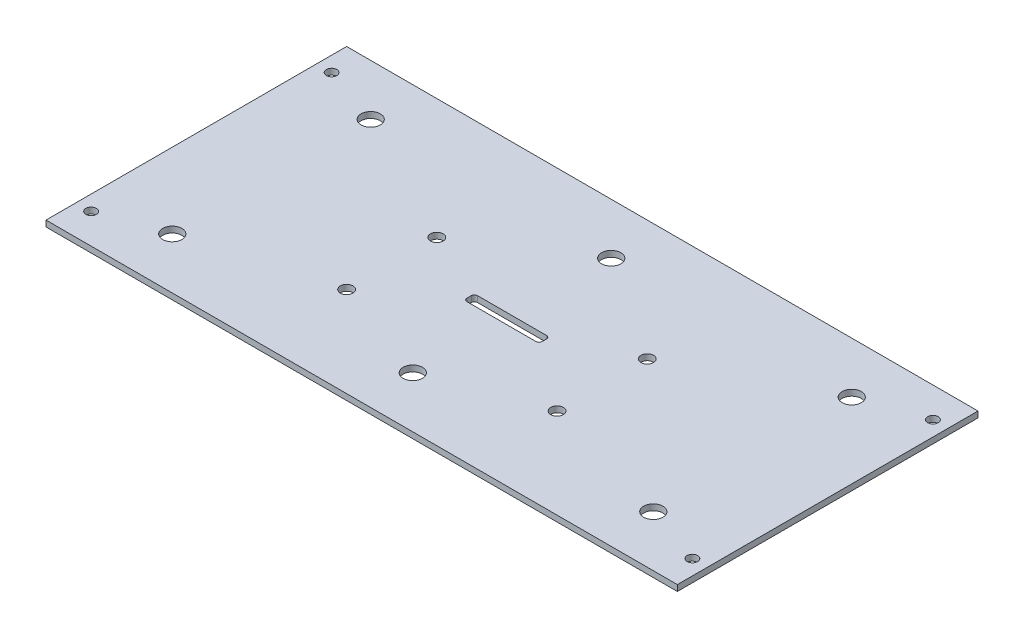
ISO-10303-21;
HEADER;
FILE_DESCRIPTION(('STEP AP214'),'2;1');
FILE_NAME('part.step','',(''),(''),'','','');
FILE_SCHEMA(('AUTOMOTIVE_DESIGN { 1 0 10303 214 1 1 1 1 }'));
ENDSEC;
DATA;
#1=APPLICATION_CONTEXT('core data for automotive mechanical design processes');
#2=APPLICATION_PROTOCOL_DEFINITION('international standard','automotive_design',2000,#1);
#3=PRODUCT_CONTEXT('',#1,'mechanical');
#4=PRODUCT('Part','Part','',(#3));
#5=PRODUCT_RELATED_PRODUCT_CATEGORY('part','',(#4));
#6=PRODUCT_DEFINITION_FORMATION('','',#4);
#7=PRODUCT_DEFINITION_CONTEXT('part definition',#1,'design');
#8=PRODUCT_DEFINITION('design','',#6,#7);
#9=PRODUCT_DEFINITION_SHAPE('','',#8);
#10=(LENGTH_UNIT() NAMED_UNIT(*) SI_UNIT(.MILLI.,.METRE.));
#11=(NAMED_UNIT(*) PLANE_ANGLE_UNIT() SI_UNIT($,.RADIAN.));
#12=(NAMED_UNIT(*) SI_UNIT($,.STERADIAN.) SOLID_ANGLE_UNIT());
#13=UNCERTAINTY_MEASURE_WITH_UNIT(LENGTH_MEASURE(1.E-05),#10,'distance_accuracy_value','');
#14=(GEOMETRIC_REPRESENTATION_CONTEXT(3) GLOBAL_UNCERTAINTY_ASSIGNED_CONTEXT((#13)) GLOBAL_UNIT_ASSIGNED_CONTEXT((#10,
#11,#12)) REPRESENTATION_CONTEXT('',''));
#15=CARTESIAN_POINT('',(0.,0.,0.));
#16=DIRECTION('',(0.,0.,1.));
#17=DIRECTION('',(1.,0.,0.));
#18=AXIS2_PLACEMENT_3D('',#15,#16,#17);
#19=CARTESIAN_POINT('',(0.,2.,0.));
#20=DIRECTION('',(0.,-1.,0.));
#21=DIRECTION('',(0.,0.,-1.));
#22=AXIS2_PLACEMENT_3D('',#19,#20,#21);
#23=PLANE('',#22);
#24=DIRECTION('',(1.,0.,0.));
#25=VECTOR('',#24,1.);
#26=CARTESIAN_POINT('',(92.5,2.,-46.5));
#27=LINE('',#26,#25);
#28=CARTESIAN_POINT('',(93.5,2.,-46.5));
#29=VERTEX_POINT('',#28);
#30=CARTESIAN_POINT('',(116.5,2.,-46.5));
#31=VERTEX_POINT('',#30);
#32=EDGE_CURVE('E278',#29,#31,#27,.T.);
#33=ORIENTED_EDGE('',*,*,#32,.F.);
#34=CARTESIAN_POINT('',(93.5,2.,-47.5));
#35=DIRECTION('',(0.,-1.,0.));
#36=DIRECTION('',(0.,0.,-1.));
#37=AXIS2_PLACEMENT_3D('',#34,#35,#36);
#38=CIRCLE('',#37,1.);
#39=CARTESIAN_POINT('',(92.5,2.,-47.5));
#40=VERTEX_POINT('',#39);
#41=EDGE_CURVE('E43',#29,#40,#38,.T.);
#42=ORIENTED_EDGE('',*,*,#41,.T.);
#43=DIRECTION('',(0.,0.,1.));
#44=VECTOR('',#43,1.);
#45=CARTESIAN_POINT('',(92.5,2.,-50.));
#46=LINE('',#45,#44);
#47=CARTESIAN_POINT('',(92.5,2.,-49.));
#48=VERTEX_POINT('',#47);
#49=EDGE_CURVE('E658',#48,#40,#46,.T.);
#50=ORIENTED_EDGE('',*,*,#49,.F.);
#51=CARTESIAN_POINT('',(93.5,2.,-49.));
#52=DIRECTION('',(0.,-1.,0.));
#53=DIRECTION('',(0.,0.,-1.));
#54=AXIS2_PLACEMENT_3D('',#51,#52,#53);
#55=CIRCLE('',#54,1.);
#56=CARTESIAN_POINT('',(93.5,2.,-50.));
#57=VERTEX_POINT('',#56);
#58=EDGE_CURVE('E57',#48,#57,#55,.T.);
#59=ORIENTED_EDGE('',*,*,#58,.T.);
#60=DIRECTION('',(-1.,0.,0.));
#61=VECTOR('',#60,1.);
#62=CARTESIAN_POINT('',(92.5,2.,-50.));
#63=LINE('',#62,#61);
#64=CARTESIAN_POINT('',(116.5,2.,-50.));
#65=VERTEX_POINT('',#64);
#66=EDGE_CURVE('E274',#65,#57,#63,.T.);
#67=ORIENTED_EDGE('',*,*,#66,.F.);
#68=CARTESIAN_POINT('',(116.5,2.,-49.));
#69=DIRECTION('',(0.,-1.,0.));
#70=DIRECTION('',(0.,0.,-1.));
#71=AXIS2_PLACEMENT_3D('',#68,#69,#70);
#72=CIRCLE('',#71,1.);
#73=CARTESIAN_POINT('',(117.5,2.,-49.));
#74=VERTEX_POINT('',#73);
#75=EDGE_CURVE('E198',#65,#74,#72,.T.);
#76=ORIENTED_EDGE('',*,*,#75,.T.);
#77=DIRECTION('',(0.,0.,-1.));
#78=VECTOR('',#77,1.);
#79=CARTESIAN_POINT('',(117.5,2.,-50.));
#80=LINE('',#79,#78);
#81=CARTESIAN_POINT('',(117.5,2.,-47.5));
#82=VERTEX_POINT('',#81);
#83=EDGE_CURVE('E268',#82,#74,#80,.T.);
#84=ORIENTED_EDGE('',*,*,#83,.F.);
#85=CARTESIAN_POINT('',(116.5,2.,-47.5));
#86=DIRECTION('',(0.,-1.,0.));
#87=DIRECTION('',(0.,0.,-1.));
#88=AXIS2_PLACEMENT_3D('',#85,#86,#87);
#89=CIRCLE('',#88,1.);
#90=EDGE_CURVE('E194',#82,#31,#89,.T.);
#91=ORIENTED_EDGE('',*,*,#90,.T.);
#92=EDGE_LOOP('',(#33,#42,#50,#59,#67,#76,#84,#91));
#93=FACE_BOUND('',#92,.T.);
#94=CARTESIAN_POINT('',(70.,2.,-60.));
#95=DIRECTION('',(0.,1.,0.));
#96=DIRECTION('',(0.,0.,1.));
#97=AXIS2_PLACEMENT_3D('',#94,#95,#96);
#98=CIRCLE('',#97,2.1);
#99=CARTESIAN_POINT('',(70.,2.,-57.9));
#100=VERTEX_POINT('',#99);
#101=EDGE_CURVE('E165',#100,#100,#98,.T.);
#102=ORIENTED_EDGE('',*,*,#101,.F.);
#103=EDGE_LOOP('',(#102));
#104=FACE_BOUND('',#103,.T.);
#105=CARTESIAN_POINT('',(140.,2.,-60.));
#106=DIRECTION('',(0.,1.,0.));
#107=DIRECTION('',(0.,0.,1.));
#108=AXIS2_PLACEMENT_3D('',#105,#106,#107);
#109=CIRCLE('',#108,2.09999999999999);
#110=CARTESIAN_POINT('',(140.,2.,-57.9));
#111=VERTEX_POINT('',#110);
#112=EDGE_CURVE('E162',#111,#111,#109,.T.);
#113=ORIENTED_EDGE('',*,*,#112,.F.);
#114=EDGE_LOOP('',(#113));
#115=FACE_BOUND('',#114,.T.);
#116=CARTESIAN_POINT('',(140.,2.,-30.));
#117=DIRECTION('',(0.,1.,0.));
#118=DIRECTION('',(0.,0.,1.));
#119=AXIS2_PLACEMENT_3D('',#116,#117,#118);
#120=CIRCLE('',#119,2.09999999999999);
#121=CARTESIAN_POINT('',(140.,2.,-27.9));
#122=VERTEX_POINT('',#121);
#123=EDGE_CURVE('E161',#122,#122,#120,.T.);
#124=ORIENTED_EDGE('',*,*,#123,.F.);
#125=EDGE_LOOP('',(#124));
#126=FACE_BOUND('',#125,.T.);
#127=CARTESIAN_POINT('',(70.,2.,-30.));
#128=DIRECTION('',(0.,1.,0.));
#129=DIRECTION('',(0.,0.,1.));
#130=AXIS2_PLACEMENT_3D('',#127,#128,#129);
#131=CIRCLE('',#130,2.1);
#132=CARTESIAN_POINT('',(70.,2.,-27.9));
#133=VERTEX_POINT('',#132);
#134=EDGE_CURVE('E289',#133,#133,#131,.T.);
#135=ORIENTED_EDGE('',*,*,#134,.F.);
#136=EDGE_LOOP('',(#135));
#137=FACE_BOUND('',#136,.T.);
#138=DIRECTION('',(0.,0.,1.));
#139=VECTOR('',#138,1.);
#140=CARTESIAN_POINT('',(0.,2.,0.));
#141=LINE('',#140,#139);
#142=CARTESIAN_POINT('',(0.,2.,-100.));
#143=VERTEX_POINT('',#142);
#144=CARTESIAN_POINT('',(0.,2.,0.));
#145=VERTEX_POINT('',#144);
#146=EDGE_CURVE('E135',#143,#145,#141,.T.);
#147=ORIENTED_EDGE('',*,*,#146,.T.);
#148=DIRECTION('',(1.,0.,0.));
#149=VECTOR('',#148,1.);
#150=CARTESIAN_POINT('',(0.,2.,0.));
#151=LINE('',#150,#149);
#152=CARTESIAN_POINT('',(210.,2.,0.));
#153=VERTEX_POINT('',#152);
#154=EDGE_CURVE('E124',#145,#153,#151,.T.);
#155=ORIENTED_EDGE('',*,*,#154,.T.);
#156=DIRECTION('',(0.,0.,-1.));
#157=VECTOR('',#156,1.);
#158=CARTESIAN_POINT('',(210.,2.,0.));
#159=LINE('',#158,#157);
#160=CARTESIAN_POINT('',(210.,2.,-100.));
#161=VERTEX_POINT('',#160);
#162=EDGE_CURVE('E134',#153,#161,#159,.T.);
#163=ORIENTED_EDGE('',*,*,#162,.T.);
#164=DIRECTION('',(-1.,0.,0.));
#165=VECTOR('',#164,1.);
#166=CARTESIAN_POINT('',(0.,2.,-100.));
#167=LINE('',#166,#165);
#168=EDGE_CURVE('E140',#161,#143,#167,.T.);
#169=ORIENTED_EDGE('',*,*,#168,.T.);
#170=EDGE_LOOP('',(#147,#155,#163,#169));
#171=FACE_BOUND('',#170,.T.);
#172=CARTESIAN_POINT('',(105.,2.,-17.));
#173=DIRECTION('',(0.,1.,0.));
#174=DIRECTION('',(0.,0.,1.));
#175=AXIS2_PLACEMENT_3D('',#172,#173,#174);
#176=CIRCLE('',#175,3.2);
#177=CARTESIAN_POINT('',(105.,2.,-13.8));
#178=VERTEX_POINT('',#177);
#179=EDGE_CURVE('E350',#178,#178,#176,.T.);
#180=ORIENTED_EDGE('',*,*,#179,.F.);
#181=EDGE_LOOP('',(#180));
#182=FACE_BOUND('',#181,.T.);
#183=CARTESIAN_POINT('',(185.,2.,-17.));
#184=DIRECTION('',(0.,1.,0.));
#185=DIRECTION('',(0.,0.,1.));
#186=AXIS2_PLACEMENT_3D('',#183,#184,#185);
#187=CIRCLE('',#186,3.20000000000001);
#188=CARTESIAN_POINT('',(185.,2.,-13.8));
#189=VERTEX_POINT('',#188);
#190=EDGE_CURVE('E344',#189,#189,#187,.T.);
#191=ORIENTED_EDGE('',*,*,#190,.F.);
#192=EDGE_LOOP('',(#191));
#193=FACE_BOUND('',#192,.T.);
#194=CARTESIAN_POINT('',(25.,2.,-17.));
#195=DIRECTION('',(0.,1.,0.));
#196=DIRECTION('',(0.,0.,-1.));
#197=AXIS2_PLACEMENT_3D('',#194,#195,#196);
#198=CIRCLE('',#197,3.2);
#199=CARTESIAN_POINT('',(25.,2.,-20.2));
#200=VERTEX_POINT('',#199);
#201=EDGE_CURVE('E338',#200,#200,#198,.T.);
#202=ORIENTED_EDGE('',*,*,#201,.F.);
#203=EDGE_LOOP('',(#202));
#204=FACE_BOUND('',#203,.T.);
#205=CARTESIAN_POINT('',(25.,2.,-83.));
#206=DIRECTION('',(0.,1.,0.));
#207=DIRECTION('',(0.,0.,1.));
#208=AXIS2_PLACEMENT_3D('',#205,#206,#207);
#209=CIRCLE('',#208,3.2);
#210=CARTESIAN_POINT('',(25.,2.,-79.8));
#211=VERTEX_POINT('',#210);
#212=EDGE_CURVE('E332',#211,#211,#209,.T.);
#213=ORIENTED_EDGE('',*,*,#212,.F.);
#214=EDGE_LOOP('',(#213));
#215=FACE_BOUND('',#214,.T.);
#216=CARTESIAN_POINT('',(105.,2.,-83.));
#217=DIRECTION('',(0.,1.,0.));
#218=DIRECTION('',(0.,0.,-1.));
#219=AXIS2_PLACEMENT_3D('',#216,#217,#218);
#220=CIRCLE('',#219,3.19999999999999);
#221=CARTESIAN_POINT('',(105.,2.,-86.2));
#222=VERTEX_POINT('',#221);
#223=EDGE_CURVE('E326',#222,#222,#220,.T.);
#224=ORIENTED_EDGE('',*,*,#223,.F.);
#225=EDGE_LOOP('',(#224));
#226=FACE_BOUND('',#225,.T.);
#227=CARTESIAN_POINT('',(185.,2.,-83.));
#228=DIRECTION('',(0.,1.,0.));
#229=DIRECTION('',(0.,0.,-1.));
#230=AXIS2_PLACEMENT_3D('',#227,#228,#229);
#231=CIRCLE('',#230,3.20000000000001);
#232=CARTESIAN_POINT('',(185.,2.,-86.2));
#233=VERTEX_POINT('',#232);
#234=EDGE_CURVE('E320',#233,#233,#231,.T.);
#235=ORIENTED_EDGE('',*,*,#234,.F.);
#236=EDGE_LOOP('',(#235));
#237=FACE_BOUND('',#236,.T.);
#238=CARTESIAN_POINT('',(5.,2.,-10.));
#239=DIRECTION('',(0.,1.,0.));
#240=DIRECTION('',(0.,0.,1.));
#241=AXIS2_PLACEMENT_3D('',#238,#239,#240);
#242=CIRCLE('',#241,1.75);
#243=CARTESIAN_POINT('',(5.,2.,-8.25));
#244=VERTEX_POINT('',#243);
#245=EDGE_CURVE('E314',#244,#244,#242,.T.);
#246=ORIENTED_EDGE('',*,*,#245,.F.);
#247=EDGE_LOOP('',(#246));
#248=FACE_BOUND('',#247,.T.);
#249=CARTESIAN_POINT('',(5.,2.,-90.));
#250=DIRECTION('',(0.,1.,0.));
#251=DIRECTION('',(0.,0.,-1.));
#252=AXIS2_PLACEMENT_3D('',#249,#250,#251);
#253=CIRCLE('',#252,1.75);
#254=CARTESIAN_POINT('',(5.,2.,-91.75));
#255=VERTEX_POINT('',#254);
#256=EDGE_CURVE('E308',#255,#255,#253,.T.);
#257=ORIENTED_EDGE('',*,*,#256,.F.);
#258=EDGE_LOOP('',(#257));
#259=FACE_BOUND('',#258,.T.);
#260=CARTESIAN_POINT('',(205.,2.,-10.));
#261=DIRECTION('',(0.,1.,0.));
#262=DIRECTION('',(0.,0.,-1.));
#263=AXIS2_PLACEMENT_3D('',#260,#261,#262);
#264=CIRCLE('',#263,1.75000000000001);
#265=CARTESIAN_POINT('',(205.,2.,-11.75));
#266=VERTEX_POINT('',#265);
#267=EDGE_CURVE('E302',#266,#266,#264,.T.);
#268=ORIENTED_EDGE('',*,*,#267,.F.);
#269=EDGE_LOOP('',(#268));
#270=FACE_BOUND('',#269,.T.);
#271=CARTESIAN_POINT('',(205.,2.,-90.));
#272=DIRECTION('',(0.,1.,0.));
#273=DIRECTION('',(0.,0.,1.));
#274=AXIS2_PLACEMENT_3D('',#271,#272,#273);
#275=CIRCLE('',#274,1.75000000000001);
#276=CARTESIAN_POINT('',(205.,2.,-88.25));
#277=VERTEX_POINT('',#276);
#278=EDGE_CURVE('E296',#277,#277,#275,.T.);
#279=ORIENTED_EDGE('',*,*,#278,.F.);
#280=EDGE_LOOP('',(#279));
#281=FACE_BOUND('',#280,.T.);
#282=ADVANCED_FACE('F35',(#93,#104,#115,#126,#137,#171,#182,#193,#204,#215,#226,#237,#248,#259,
#270,#281),#23,.F.);
#283=CARTESIAN_POINT('',(0.,0.,0.));
#284=DIRECTION('',(0.,-1.,0.));
#285=DIRECTION('',(0.,0.,-1.));
#286=AXIS2_PLACEMENT_3D('',#283,#284,#285);
#287=PLANE('',#286);
#288=DIRECTION('',(0.,0.,-1.));
#289=VECTOR('',#288,1.);
#290=CARTESIAN_POINT('',(92.5,0.,0.));
#291=LINE('',#290,#289);
#292=CARTESIAN_POINT('',(92.5,0.,-47.5));
#293=VERTEX_POINT('',#292);
#294=CARTESIAN_POINT('',(92.5,0.,-49.));
#295=VERTEX_POINT('',#294);
#296=EDGE_CURVE('E172',#293,#295,#291,.T.);
#297=ORIENTED_EDGE('',*,*,#296,.F.);
#298=CARTESIAN_POINT('',(93.5,0.,-47.5));
#299=DIRECTION('',(0.,-1.,0.));
#300=DIRECTION('',(0.,0.,-1.));
#301=AXIS2_PLACEMENT_3D('',#298,#299,#300);
#302=CIRCLE('',#301,1.);
#303=CARTESIAN_POINT('',(93.5,0.,-46.5));
#304=VERTEX_POINT('',#303);
#305=EDGE_CURVE('E11',#293,#304,#302,.F.);
#306=ORIENTED_EDGE('',*,*,#305,.T.);
#307=DIRECTION('',(-1.,0.,0.));
#308=VECTOR('',#307,1.);
#309=CARTESIAN_POINT('',(0.,0.,-46.5));
#310=LINE('',#309,#308);
#311=CARTESIAN_POINT('',(116.5,0.,-46.5));
#312=VERTEX_POINT('',#311);
#313=EDGE_CURVE('E149',#312,#304,#310,.T.);
#314=ORIENTED_EDGE('',*,*,#313,.F.);
#315=CARTESIAN_POINT('',(116.5,0.,-47.5));
#316=DIRECTION('',(0.,-1.,0.));
#317=DIRECTION('',(0.,0.,-1.));
#318=AXIS2_PLACEMENT_3D('',#315,#316,#317);
#319=CIRCLE('',#318,1.);
#320=CARTESIAN_POINT('',(117.5,0.,-47.5));
#321=VERTEX_POINT('',#320);
#322=EDGE_CURVE('E196',#312,#321,#319,.F.);
#323=ORIENTED_EDGE('',*,*,#322,.T.);
#324=DIRECTION('',(0.,0.,1.));
#325=VECTOR('',#324,1.);
#326=CARTESIAN_POINT('',(117.5,0.,0.));
#327=LINE('',#326,#325);
#328=CARTESIAN_POINT('',(117.5,0.,-49.));
#329=VERTEX_POINT('',#328);
#330=EDGE_CURVE('E152',#329,#321,#327,.T.);
#331=ORIENTED_EDGE('',*,*,#330,.F.);
#332=CARTESIAN_POINT('',(116.5,0.,-49.));
#333=DIRECTION('',(0.,-1.,0.));
#334=DIRECTION('',(0.,0.,-1.));
#335=AXIS2_PLACEMENT_3D('',#332,#333,#334);
#336=CIRCLE('',#335,1.);
#337=CARTESIAN_POINT('',(116.5,0.,-50.));
#338=VERTEX_POINT('',#337);
#339=EDGE_CURVE('E200',#329,#338,#336,.F.);
#340=ORIENTED_EDGE('',*,*,#339,.T.);
#341=DIRECTION('',(1.,0.,0.));
#342=VECTOR('',#341,1.);
#343=CARTESIAN_POINT('',(0.,0.,-50.));
#344=LINE('',#343,#342);
#345=CARTESIAN_POINT('',(93.5,0.,-50.));
#346=VERTEX_POINT('',#345);
#347=EDGE_CURVE('E169',#346,#338,#344,.T.);
#348=ORIENTED_EDGE('',*,*,#347,.F.);
#349=CARTESIAN_POINT('',(93.5,0.,-49.));
#350=DIRECTION('',(0.,-1.,0.));
#351=DIRECTION('',(0.,0.,-1.));
#352=AXIS2_PLACEMENT_3D('',#349,#350,#351);
#353=CIRCLE('',#352,1.);
#354=EDGE_CURVE('E203',#346,#295,#353,.F.);
#355=ORIENTED_EDGE('',*,*,#354,.T.);
#356=EDGE_LOOP('',(#297,#306,#314,#323,#331,#340,#348,#355));
#357=FACE_BOUND('',#356,.T.);
#358=CARTESIAN_POINT('',(70.,0.,-60.));
#359=DIRECTION('',(0.,-1.,0.));
#360=DIRECTION('',(0.,0.,-1.));
#361=AXIS2_PLACEMENT_3D('',#358,#359,#360);
#362=CIRCLE('',#361,2.1);
#363=CARTESIAN_POINT('',(70.,0.,-62.1));
#364=VERTEX_POINT('',#363);
#365=EDGE_CURVE('E163',#364,#364,#362,.T.);
#366=ORIENTED_EDGE('',*,*,#365,.F.);
#367=EDGE_LOOP('',(#366));
#368=FACE_BOUND('',#367,.T.);
#369=CARTESIAN_POINT('',(140.,0.,-60.));
#370=DIRECTION('',(0.,-1.,0.));
#371=DIRECTION('',(0.,0.,-1.));
#372=AXIS2_PLACEMENT_3D('',#369,#370,#371);
#373=CIRCLE('',#372,2.09999999999999);
#374=CARTESIAN_POINT('',(140.,0.,-62.1));
#375=VERTEX_POINT('',#374);
#376=EDGE_CURVE('E158',#375,#375,#373,.T.);
#377=ORIENTED_EDGE('',*,*,#376,.F.);
#378=EDGE_LOOP('',(#377));
#379=FACE_BOUND('',#378,.T.);
#380=CARTESIAN_POINT('',(140.,0.,-30.));
#381=DIRECTION('',(0.,-1.,0.));
#382=DIRECTION('',(0.,0.,-1.));
#383=AXIS2_PLACEMENT_3D('',#380,#381,#382);
#384=CIRCLE('',#383,2.09999999999999);
#385=CARTESIAN_POINT('',(140.,0.,-32.1));
#386=VERTEX_POINT('',#385);
#387=EDGE_CURVE('E286',#386,#386,#384,.T.);
#388=ORIENTED_EDGE('',*,*,#387,.F.);
#389=EDGE_LOOP('',(#388));
#390=FACE_BOUND('',#389,.T.);
#391=CARTESIAN_POINT('',(70.,0.,-30.));
#392=DIRECTION('',(0.,-1.,0.));
#393=DIRECTION('',(0.,0.,-1.));
#394=AXIS2_PLACEMENT_3D('',#391,#392,#393);
#395=CIRCLE('',#394,2.1);
#396=CARTESIAN_POINT('',(70.,0.,-32.1));
#397=VERTEX_POINT('',#396);
#398=EDGE_CURVE('E292',#397,#397,#395,.T.);
#399=ORIENTED_EDGE('',*,*,#398,.F.);
#400=EDGE_LOOP('',(#399));
#401=FACE_BOUND('',#400,.T.);
#402=CARTESIAN_POINT('',(205.,0.,-10.));
#403=DIRECTION('',(0.,1.,0.));
#404=DIRECTION('',(0.,0.,-1.));
#405=AXIS2_PLACEMENT_3D('',#402,#403,#404);
#406=CIRCLE('',#405,1.75000000000001);
#407=CARTESIAN_POINT('',(205.,0.,-11.75));
#408=VERTEX_POINT('',#407);
#409=EDGE_CURVE('E299',#408,#408,#406,.T.);
#410=ORIENTED_EDGE('',*,*,#409,.T.);
#411=EDGE_LOOP('',(#410));
#412=FACE_BOUND('',#411,.T.);
#413=CARTESIAN_POINT('',(5.,0.,-10.));
#414=DIRECTION('',(0.,1.,0.));
#415=DIRECTION('',(0.,0.,1.));
#416=AXIS2_PLACEMENT_3D('',#413,#414,#415);
#417=CIRCLE('',#416,1.75);
#418=CARTESIAN_POINT('',(5.,0.,-8.25));
#419=VERTEX_POINT('',#418);
#420=EDGE_CURVE('E311',#419,#419,#417,.T.);
#421=ORIENTED_EDGE('',*,*,#420,.T.);
#422=EDGE_LOOP('',(#421));
#423=FACE_BOUND('',#422,.T.);
#424=CARTESIAN_POINT('',(105.,0.,-83.));
#425=DIRECTION('',(0.,1.,0.));
#426=DIRECTION('',(0.,0.,-1.));
#427=AXIS2_PLACEMENT_3D('',#424,#425,#426);
#428=CIRCLE('',#427,3.19999999999999);
#429=CARTESIAN_POINT('',(105.,0.,-86.2));
#430=VERTEX_POINT('',#429);
#431=EDGE_CURVE('E323',#430,#430,#428,.T.);
#432=ORIENTED_EDGE('',*,*,#431,.T.);
#433=EDGE_LOOP('',(#432));
#434=FACE_BOUND('',#433,.T.);
#435=CARTESIAN_POINT('',(25.,0.,-17.));
#436=DIRECTION('',(0.,1.,0.));
#437=DIRECTION('',(0.,0.,-1.));
#438=AXIS2_PLACEMENT_3D('',#435,#436,#437);
#439=CIRCLE('',#438,3.2);
#440=CARTESIAN_POINT('',(25.,0.,-20.2));
#441=VERTEX_POINT('',#440);
#442=EDGE_CURVE('E335',#441,#441,#439,.T.);
#443=ORIENTED_EDGE('',*,*,#442,.T.);
#444=EDGE_LOOP('',(#443));
#445=FACE_BOUND('',#444,.T.);
#446=CARTESIAN_POINT('',(105.,0.,-17.));
#447=DIRECTION('',(0.,1.,0.));
#448=DIRECTION('',(0.,0.,1.));
#449=AXIS2_PLACEMENT_3D('',#446,#447,#448);
#450=CIRCLE('',#449,3.2);
#451=CARTESIAN_POINT('',(105.,0.,-13.8));
#452=VERTEX_POINT('',#451);
#453=EDGE_CURVE('E347',#452,#452,#450,.T.);
#454=ORIENTED_EDGE('',*,*,#453,.T.);
#455=EDGE_LOOP('',(#454));
#456=FACE_BOUND('',#455,.T.);
#457=DIRECTION('',(0.,0.,1.));
#458=VECTOR('',#457,1.);
#459=CARTESIAN_POINT('',(0.,0.,0.));
#460=LINE('',#459,#458);
#461=CARTESIAN_POINT('',(0.,0.,-100.));
#462=VERTEX_POINT('',#461);
#463=CARTESIAN_POINT('',(0.,0.,0.));
#464=VERTEX_POINT('',#463);
#465=EDGE_CURVE('E148',#462,#464,#460,.T.);
#466=ORIENTED_EDGE('',*,*,#465,.F.);
#467=DIRECTION('',(-1.,0.,0.));
#468=VECTOR('',#467,1.);
#469=CARTESIAN_POINT('',(0.,0.,-100.));
#470=LINE('',#469,#468);
#471=CARTESIAN_POINT('',(210.,0.,-100.));
#472=VERTEX_POINT('',#471);
#473=EDGE_CURVE('E144',#472,#462,#470,.T.);
#474=ORIENTED_EDGE('',*,*,#473,.F.);
#475=DIRECTION('',(0.,0.,-1.));
#476=VECTOR('',#475,1.);
#477=CARTESIAN_POINT('',(210.,0.,0.));
#478=LINE('',#477,#476);
#479=CARTESIAN_POINT('',(210.,0.,0.));
#480=VERTEX_POINT('',#479);
#481=EDGE_CURVE('E361',#480,#472,#478,.T.);
#482=ORIENTED_EDGE('',*,*,#481,.F.);
#483=DIRECTION('',(1.,0.,0.));
#484=VECTOR('',#483,1.);
#485=CARTESIAN_POINT('',(0.,0.,0.));
#486=LINE('',#485,#484);
#487=EDGE_CURVE('E359',#464,#480,#486,.T.);
#488=ORIENTED_EDGE('',*,*,#487,.F.);
#489=EDGE_LOOP('',(#466,#474,#482,#488));
#490=FACE_BOUND('',#489,.T.);
#491=CARTESIAN_POINT('',(185.,0.,-17.));
#492=DIRECTION('',(0.,1.,0.));
#493=DIRECTION('',(0.,0.,1.));
#494=AXIS2_PLACEMENT_3D('',#491,#492,#493);
#495=CIRCLE('',#494,3.20000000000001);
#496=CARTESIAN_POINT('',(185.,0.,-13.8));
#497=VERTEX_POINT('',#496);
#498=EDGE_CURVE('E341',#497,#497,#495,.T.);
#499=ORIENTED_EDGE('',*,*,#498,.T.);
#500=EDGE_LOOP('',(#499));
#501=FACE_BOUND('',#500,.T.);
#502=CARTESIAN_POINT('',(25.,0.,-83.));
#503=DIRECTION('',(0.,1.,0.));
#504=DIRECTION('',(0.,0.,1.));
#505=AXIS2_PLACEMENT_3D('',#502,#503,#504);
#506=CIRCLE('',#505,3.2);
#507=CARTESIAN_POINT('',(25.,0.,-79.8));
#508=VERTEX_POINT('',#507);
#509=EDGE_CURVE('E329',#508,#508,#506,.T.);
#510=ORIENTED_EDGE('',*,*,#509,.T.);
#511=EDGE_LOOP('',(#510));
#512=FACE_BOUND('',#511,.T.);
#513=CARTESIAN_POINT('',(185.,0.,-83.));
#514=DIRECTION('',(0.,1.,0.));
#515=DIRECTION('',(0.,0.,-1.));
#516=AXIS2_PLACEMENT_3D('',#513,#514,#515);
#517=CIRCLE('',#516,3.20000000000001);
#518=CARTESIAN_POINT('',(185.,0.,-86.2));
#519=VERTEX_POINT('',#518);
#520=EDGE_CURVE('E317',#519,#519,#517,.T.);
#521=ORIENTED_EDGE('',*,*,#520,.T.);
#522=EDGE_LOOP('',(#521));
#523=FACE_BOUND('',#522,.T.);
#524=CARTESIAN_POINT('',(5.,0.,-90.));
#525=DIRECTION('',(0.,1.,0.));
#526=DIRECTION('',(0.,0.,-1.));
#527=AXIS2_PLACEMENT_3D('',#524,#525,#526);
#528=CIRCLE('',#527,1.75);
#529=CARTESIAN_POINT('',(5.,0.,-91.75));
#530=VERTEX_POINT('',#529);
#531=EDGE_CURVE('E305',#530,#530,#528,.T.);
#532=ORIENTED_EDGE('',*,*,#531,.T.);
#533=EDGE_LOOP('',(#532));
#534=FACE_BOUND('',#533,.T.);
#535=CARTESIAN_POINT('',(205.,0.,-90.));
#536=DIRECTION('',(0.,1.,0.));
#537=DIRECTION('',(0.,0.,1.));
#538=AXIS2_PLACEMENT_3D('',#535,#536,#537);
#539=CIRCLE('',#538,1.75000000000001);
#540=CARTESIAN_POINT('',(205.,0.,-88.25));
#541=VERTEX_POINT('',#540);
#542=EDGE_CURVE('E295',#541,#541,#539,.T.);
#543=ORIENTED_EDGE('',*,*,#542,.T.);
#544=EDGE_LOOP('',(#543));
#545=FACE_BOUND('',#544,.T.);
#546=ADVANCED_FACE('F208',(#357,#368,#379,#390,#401,#412,#423,#434,#445,#456,#490,#501,#512,
#523,#534,#545),#287,.T.);
#547=CARTESIAN_POINT('',(0.,2.,0.));
#548=DIRECTION('',(1.,0.,0.));
#549=DIRECTION('',(0.,0.,-1.));
#550=AXIS2_PLACEMENT_3D('',#547,#548,#549);
#551=PLANE('',#550);
#552=ORIENTED_EDGE('',*,*,#465,.T.);
#553=DIRECTION('',(0.,-1.,0.));
#554=VECTOR('',#553,1.);
#555=CARTESIAN_POINT('',(0.,2.,0.));
#556=LINE('',#555,#554);
#557=EDGE_CURVE('E128',#145,#464,#556,.T.);
#558=ORIENTED_EDGE('',*,*,#557,.F.);
#559=ORIENTED_EDGE('',*,*,#146,.F.);
#560=DIRECTION('',(0.,-1.,0.));
#561=VECTOR('',#560,1.);
#562=CARTESIAN_POINT('',(0.,2.,-100.));
#563=LINE('',#562,#561);
#564=EDGE_CURVE('E357',#143,#462,#563,.T.);
#565=ORIENTED_EDGE('',*,*,#564,.T.);
#566=EDGE_LOOP('',(#552,#558,#559,#565));
#567=FACE_BOUND('',#566,.T.);
#568=ADVANCED_FACE('F146',(#567),#551,.F.);
#569=CARTESIAN_POINT('',(0.,2.,0.));
#570=DIRECTION('',(0.,0.,-1.));
#571=DIRECTION('',(-1.,0.,0.));
#572=AXIS2_PLACEMENT_3D('',#569,#570,#571);
#573=PLANE('',#572);
#574=ORIENTED_EDGE('',*,*,#487,.T.);
#575=DIRECTION('',(0.,-1.,0.));
#576=VECTOR('',#575,1.);
#577=CARTESIAN_POINT('',(210.,2.,0.));
#578=LINE('',#577,#576);
#579=EDGE_CURVE('E131',#153,#480,#578,.T.);
#580=ORIENTED_EDGE('',*,*,#579,.F.);
#581=ORIENTED_EDGE('',*,*,#154,.F.);
#582=ORIENTED_EDGE('',*,*,#557,.T.);
#583=EDGE_LOOP('',(#574,#580,#581,#582));
#584=FACE_BOUND('',#583,.T.);
#585=ADVANCED_FACE('F126',(#584),#573,.F.);
#586=CARTESIAN_POINT('',(210.,2.,0.));
#587=DIRECTION('',(-1.,0.,0.));
#588=DIRECTION('',(0.,0.,1.));
#589=AXIS2_PLACEMENT_3D('',#586,#587,#588);
#590=PLANE('',#589);
#591=ORIENTED_EDGE('',*,*,#481,.T.);
#592=DIRECTION('',(0.,-1.,0.));
#593=VECTOR('',#592,1.);
#594=CARTESIAN_POINT('',(210.,2.,-100.));
#595=LINE('',#594,#593);
#596=EDGE_CURVE('E154',#161,#472,#595,.T.);
#597=ORIENTED_EDGE('',*,*,#596,.F.);
#598=ORIENTED_EDGE('',*,*,#162,.F.);
#599=ORIENTED_EDGE('',*,*,#579,.T.);
#600=EDGE_LOOP('',(#591,#597,#598,#599));
#601=FACE_BOUND('',#600,.T.);
#602=ADVANCED_FACE('F240',(#601),#590,.F.);
#603=CARTESIAN_POINT('',(0.,2.,-100.));
#604=DIRECTION('',(0.,0.,1.));
#605=DIRECTION('',(1.,0.,0.));
#606=AXIS2_PLACEMENT_3D('',#603,#604,#605);
#607=PLANE('',#606);
#608=ORIENTED_EDGE('',*,*,#473,.T.);
#609=ORIENTED_EDGE('',*,*,#564,.F.);
#610=ORIENTED_EDGE('',*,*,#168,.F.);
#611=ORIENTED_EDGE('',*,*,#596,.T.);
#612=EDGE_LOOP('',(#608,#609,#610,#611));
#613=FACE_BOUND('',#612,.T.);
#614=ADVANCED_FACE('F237',(#613),#607,.F.);
#615=CARTESIAN_POINT('',(105.,2.,-17.));
#616=DIRECTION('',(0.,-1.,0.));
#617=DIRECTION('',(0.,0.,-1.));
#618=AXIS2_PLACEMENT_3D('',#615,#616,#617);
#619=CYLINDRICAL_SURFACE('',#618,3.2);
#620=ORIENTED_EDGE('',*,*,#179,.T.);
#621=EDGE_LOOP('',(#620));
#622=FACE_BOUND('',#621,.T.);
#623=ORIENTED_EDGE('',*,*,#453,.F.);
#624=EDGE_LOOP('',(#623));
#625=FACE_BOUND('',#624,.T.);
#626=ADVANCED_FACE('F234',(#622,#625),#619,.F.);
#627=CARTESIAN_POINT('',(185.,2.,-17.));
#628=DIRECTION('',(0.,-1.,0.));
#629=DIRECTION('',(0.,0.,-1.));
#630=AXIS2_PLACEMENT_3D('',#627,#628,#629);
#631=CYLINDRICAL_SURFACE('',#630,3.20000000000001);
#632=ORIENTED_EDGE('',*,*,#190,.T.);
#633=EDGE_LOOP('',(#632));
#634=FACE_BOUND('',#633,.T.);
#635=ORIENTED_EDGE('',*,*,#498,.F.);
#636=EDGE_LOOP('',(#635));
#637=FACE_BOUND('',#636,.T.);
#638=ADVANCED_FACE('F419',(#634,#637),#631,.F.);
#639=CARTESIAN_POINT('',(25.,2.,-17.));
#640=DIRECTION('',(0.,-1.,0.));
#641=DIRECTION('',(0.,0.,-1.));
#642=AXIS2_PLACEMENT_3D('',#639,#640,#641);
#643=CYLINDRICAL_SURFACE('',#642,3.2);
#644=ORIENTED_EDGE('',*,*,#201,.T.);
#645=EDGE_LOOP('',(#644));
#646=FACE_BOUND('',#645,.T.);
#647=ORIENTED_EDGE('',*,*,#442,.F.);
#648=EDGE_LOOP('',(#647));
#649=FACE_BOUND('',#648,.T.);
#650=ADVANCED_FACE('F416',(#646,#649),#643,.F.);
#651=CARTESIAN_POINT('',(25.,2.,-83.));
#652=DIRECTION('',(0.,-1.,0.));
#653=DIRECTION('',(0.,0.,-1.));
#654=AXIS2_PLACEMENT_3D('',#651,#652,#653);
#655=CYLINDRICAL_SURFACE('',#654,3.2);
#656=ORIENTED_EDGE('',*,*,#212,.T.);
#657=EDGE_LOOP('',(#656));
#658=FACE_BOUND('',#657,.T.);
#659=ORIENTED_EDGE('',*,*,#509,.F.);
#660=EDGE_LOOP('',(#659));
#661=FACE_BOUND('',#660,.T.);
#662=ADVANCED_FACE('F412',(#658,#661),#655,.F.);
#663=CARTESIAN_POINT('',(105.,2.,-83.));
#664=DIRECTION('',(0.,-1.,0.));
#665=DIRECTION('',(0.,0.,-1.));
#666=AXIS2_PLACEMENT_3D('',#663,#664,#665);
#667=CYLINDRICAL_SURFACE('',#666,3.19999999999999);
#668=ORIENTED_EDGE('',*,*,#223,.T.);
#669=EDGE_LOOP('',(#668));
#670=FACE_BOUND('',#669,.T.);
#671=ORIENTED_EDGE('',*,*,#431,.F.);
#672=EDGE_LOOP('',(#671));
#673=FACE_BOUND('',#672,.T.);
#674=ADVANCED_FACE('F408',(#670,#673),#667,.F.);
#675=CARTESIAN_POINT('',(185.,2.,-83.));
#676=DIRECTION('',(0.,-1.,0.));
#677=DIRECTION('',(0.,0.,-1.));
#678=AXIS2_PLACEMENT_3D('',#675,#676,#677);
#679=CYLINDRICAL_SURFACE('',#678,3.20000000000001);
#680=ORIENTED_EDGE('',*,*,#234,.T.);
#681=EDGE_LOOP('',(#680));
#682=FACE_BOUND('',#681,.T.);
#683=ORIENTED_EDGE('',*,*,#520,.F.);
#684=EDGE_LOOP('',(#683));
#685=FACE_BOUND('',#684,.T.);
#686=ADVANCED_FACE('F404',(#682,#685),#679,.F.);
#687=CARTESIAN_POINT('',(5.,2.,-10.));
#688=DIRECTION('',(0.,-1.,0.));
#689=DIRECTION('',(0.,0.,-1.));
#690=AXIS2_PLACEMENT_3D('',#687,#688,#689);
#691=CYLINDRICAL_SURFACE('',#690,1.75);
#692=ORIENTED_EDGE('',*,*,#245,.T.);
#693=EDGE_LOOP('',(#692));
#694=FACE_BOUND('',#693,.T.);
#695=ORIENTED_EDGE('',*,*,#420,.F.);
#696=EDGE_LOOP('',(#695));
#697=FACE_BOUND('',#696,.T.);
#698=ADVANCED_FACE('F400',(#694,#697),#691,.F.);
#699=CARTESIAN_POINT('',(5.,2.,-90.));
#700=DIRECTION('',(0.,-1.,0.));
#701=DIRECTION('',(0.,0.,-1.));
#702=AXIS2_PLACEMENT_3D('',#699,#700,#701);
#703=CYLINDRICAL_SURFACE('',#702,1.75);
#704=ORIENTED_EDGE('',*,*,#256,.T.);
#705=EDGE_LOOP('',(#704));
#706=FACE_BOUND('',#705,.T.);
#707=ORIENTED_EDGE('',*,*,#531,.F.);
#708=EDGE_LOOP('',(#707));
#709=FACE_BOUND('',#708,.T.);
#710=ADVANCED_FACE('F393',(#706,#709),#703,.F.);
#711=CARTESIAN_POINT('',(205.,2.,-10.));
#712=DIRECTION('',(0.,-1.,0.));
#713=DIRECTION('',(0.,0.,-1.));
#714=AXIS2_PLACEMENT_3D('',#711,#712,#713);
#715=CYLINDRICAL_SURFACE('',#714,1.75000000000001);
#716=ORIENTED_EDGE('',*,*,#267,.T.);
#717=EDGE_LOOP('',(#716));
#718=FACE_BOUND('',#717,.T.);
#719=ORIENTED_EDGE('',*,*,#409,.F.);
#720=EDGE_LOOP('',(#719));
#721=FACE_BOUND('',#720,.T.);
#722=ADVANCED_FACE('F383',(#718,#721),#715,.F.);
#723=CARTESIAN_POINT('',(205.,2.,-90.));
#724=DIRECTION('',(0.,-1.,0.));
#725=DIRECTION('',(0.,0.,-1.));
#726=AXIS2_PLACEMENT_3D('',#723,#724,#725);
#727=CYLINDRICAL_SURFACE('',#726,1.75000000000001);
#728=ORIENTED_EDGE('',*,*,#278,.T.);
#729=EDGE_LOOP('',(#728));
#730=FACE_BOUND('',#729,.T.);
#731=ORIENTED_EDGE('',*,*,#542,.F.);
#732=EDGE_LOOP('',(#731));
#733=FACE_BOUND('',#732,.T.);
#734=ADVANCED_FACE('F380',(#730,#733),#727,.F.);
#735=CARTESIAN_POINT('',(70.,2.,-30.));
#736=DIRECTION('',(0.,1.,0.));
#737=DIRECTION('',(0.,0.,1.));
#738=AXIS2_PLACEMENT_3D('',#735,#736,#737);
#739=CYLINDRICAL_SURFACE('',#738,2.1);
#740=ORIENTED_EDGE('',*,*,#398,.T.);
#741=EDGE_LOOP('',(#740));
#742=FACE_BOUND('',#741,.T.);
#743=ORIENTED_EDGE('',*,*,#134,.T.);
#744=EDGE_LOOP('',(#743));
#745=FACE_BOUND('',#744,.T.);
#746=ADVANCED_FACE('F382',(#742,#745),#739,.F.);
#747=CARTESIAN_POINT('',(140.,2.,-30.));
#748=DIRECTION('',(0.,1.,0.));
#749=DIRECTION('',(0.,0.,1.));
#750=AXIS2_PLACEMENT_3D('',#747,#748,#749);
#751=CYLINDRICAL_SURFACE('',#750,2.09999999999999);
#752=ORIENTED_EDGE('',*,*,#387,.T.);
#753=EDGE_LOOP('',(#752));
#754=FACE_BOUND('',#753,.T.);
#755=ORIENTED_EDGE('',*,*,#123,.T.);
#756=EDGE_LOOP('',(#755));
#757=FACE_BOUND('',#756,.T.);
#758=ADVANCED_FACE('F390',(#754,#757),#751,.F.);
#759=CARTESIAN_POINT('',(140.,2.,-60.));
#760=DIRECTION('',(0.,1.,0.));
#761=DIRECTION('',(0.,0.,1.));
#762=AXIS2_PLACEMENT_3D('',#759,#760,#761);
#763=CYLINDRICAL_SURFACE('',#762,2.09999999999999);
#764=ORIENTED_EDGE('',*,*,#376,.T.);
#765=EDGE_LOOP('',(#764));
#766=FACE_BOUND('',#765,.T.);
#767=ORIENTED_EDGE('',*,*,#112,.T.);
#768=EDGE_LOOP('',(#767));
#769=FACE_BOUND('',#768,.T.);
#770=ADVANCED_FACE('F550',(#766,#769),#763,.F.);
#771=CARTESIAN_POINT('',(70.,2.,-60.));
#772=DIRECTION('',(0.,1.,0.));
#773=DIRECTION('',(0.,0.,1.));
#774=AXIS2_PLACEMENT_3D('',#771,#772,#773);
#775=CYLINDRICAL_SURFACE('',#774,2.1);
#776=ORIENTED_EDGE('',*,*,#365,.T.);
#777=EDGE_LOOP('',(#776));
#778=FACE_BOUND('',#777,.T.);
#779=ORIENTED_EDGE('',*,*,#101,.T.);
#780=EDGE_LOOP('',(#779));
#781=FACE_BOUND('',#780,.T.);
#782=ADVANCED_FACE('F500',(#778,#781),#775,.F.);
#783=CARTESIAN_POINT('',(92.5,-8.,-50.));
#784=DIRECTION('',(-1.,0.,0.));
#785=DIRECTION('',(0.,0.,1.));
#786=AXIS2_PLACEMENT_3D('',#783,#784,#785);
#787=PLANE('',#786);
#788=ORIENTED_EDGE('',*,*,#296,.T.);
#789=DIRECTION('',(0.,1.,0.));
#790=VECTOR('',#789,1.);
#791=CARTESIAN_POINT('',(92.5,2.,-49.));
#792=LINE('',#791,#790);
#793=EDGE_CURVE('E192',#295,#48,#792,.T.);
#794=ORIENTED_EDGE('',*,*,#793,.T.);
#795=ORIENTED_EDGE('',*,*,#49,.T.);
#796=DIRECTION('',(0.,1.,0.));
#797=VECTOR('',#796,1.);
#798=CARTESIAN_POINT('',(92.5,0.,-47.5));
#799=LINE('',#798,#797);
#800=EDGE_CURVE('E190',#40,#293,#799,.F.);
#801=ORIENTED_EDGE('',*,*,#800,.T.);
#802=EDGE_LOOP('',(#788,#794,#795,#801));
#803=FACE_BOUND('',#802,.T.);
#804=ADVANCED_FACE('F212',(#803),#787,.F.);
#805=CARTESIAN_POINT('',(92.5,-8.,-50.));
#806=DIRECTION('',(0.,0.,-1.));
#807=DIRECTION('',(-1.,0.,0.));
#808=AXIS2_PLACEMENT_3D('',#805,#806,#807);
#809=PLANE('',#808);
#810=ORIENTED_EDGE('',*,*,#347,.T.);
#811=DIRECTION('',(0.,1.,0.));
#812=VECTOR('',#811,1.);
#813=CARTESIAN_POINT('',(116.5,2.,-50.));
#814=LINE('',#813,#812);
#815=EDGE_CURVE('E187',#338,#65,#814,.T.);
#816=ORIENTED_EDGE('',*,*,#815,.T.);
#817=ORIENTED_EDGE('',*,*,#66,.T.);
#818=DIRECTION('',(0.,1.,0.));
#819=VECTOR('',#818,1.);
#820=CARTESIAN_POINT('',(93.5,0.,-50.));
#821=LINE('',#820,#819);
#822=EDGE_CURVE('E185',#57,#346,#821,.F.);
#823=ORIENTED_EDGE('',*,*,#822,.T.);
#824=EDGE_LOOP('',(#810,#816,#817,#823));
#825=FACE_BOUND('',#824,.T.);
#826=ADVANCED_FACE('F271',(#825),#809,.F.);
#827=CARTESIAN_POINT('',(117.5,-8.,-50.));
#828=DIRECTION('',(1.,0.,0.));
#829=DIRECTION('',(0.,0.,-1.));
#830=AXIS2_PLACEMENT_3D('',#827,#828,#829);
#831=PLANE('',#830);
#832=ORIENTED_EDGE('',*,*,#330,.T.);
#833=DIRECTION('',(0.,1.,0.));
#834=VECTOR('',#833,1.);
#835=CARTESIAN_POINT('',(117.5,2.,-47.5));
#836=LINE('',#835,#834);
#837=EDGE_CURVE('E177',#321,#82,#836,.T.);
#838=ORIENTED_EDGE('',*,*,#837,.T.);
#839=ORIENTED_EDGE('',*,*,#83,.T.);
#840=DIRECTION('',(0.,1.,0.));
#841=VECTOR('',#840,1.);
#842=CARTESIAN_POINT('',(117.5,0.,-49.));
#843=LINE('',#842,#841);
#844=EDGE_CURVE('E175',#74,#329,#843,.F.);
#845=ORIENTED_EDGE('',*,*,#844,.T.);
#846=EDGE_LOOP('',(#832,#838,#839,#845));
#847=FACE_BOUND('',#846,.T.);
#848=ADVANCED_FACE('F255',(#847),#831,.F.);
#849=CARTESIAN_POINT('',(92.5,-8.,-46.5));
#850=DIRECTION('',(0.,0.,1.));
#851=DIRECTION('',(1.,0.,0.));
#852=AXIS2_PLACEMENT_3D('',#849,#850,#851);
#853=PLANE('',#852);
#854=ORIENTED_EDGE('',*,*,#32,.T.);
#855=DIRECTION('',(0.,1.,0.));
#856=VECTOR('',#855,1.);
#857=CARTESIAN_POINT('',(116.5,0.,-46.5));
#858=LINE('',#857,#856);
#859=EDGE_CURVE('E183',#31,#312,#858,.F.);
#860=ORIENTED_EDGE('',*,*,#859,.T.);
#861=ORIENTED_EDGE('',*,*,#313,.T.);
#862=DIRECTION('',(0.,1.,0.));
#863=VECTOR('',#862,1.);
#864=CARTESIAN_POINT('',(93.5,2.,-46.5));
#865=LINE('',#864,#863);
#866=EDGE_CURVE('E180',#304,#29,#865,.T.);
#867=ORIENTED_EDGE('',*,*,#866,.T.);
#868=EDGE_LOOP('',(#854,#860,#861,#867));
#869=FACE_BOUND('',#868,.T.);
#870=ADVANCED_FACE('F250',(#869),#853,.F.);
#871=CARTESIAN_POINT('',(116.5,-8.,-47.5));
#872=DIRECTION('',(0.,-1.,0.));
#873=DIRECTION('',(0.,0.,-1.));
#874=AXIS2_PLACEMENT_3D('',#871,#872,#873);
#875=CYLINDRICAL_SURFACE('',#874,1.);
#876=ORIENTED_EDGE('',*,*,#322,.F.);
#877=ORIENTED_EDGE('',*,*,#859,.F.);
#878=ORIENTED_EDGE('',*,*,#90,.F.);
#879=ORIENTED_EDGE('',*,*,#837,.F.);
#880=EDGE_LOOP('',(#876,#877,#878,#879));
#881=FACE_BOUND('',#880,.T.);
#882=ADVANCED_FACE('F222',(#881),#875,.F.);
#883=CARTESIAN_POINT('',(116.5,-8.,-49.));
#884=DIRECTION('',(0.,-1.,0.));
#885=DIRECTION('',(0.,0.,-1.));
#886=AXIS2_PLACEMENT_3D('',#883,#884,#885);
#887=CYLINDRICAL_SURFACE('',#886,1.);
#888=ORIENTED_EDGE('',*,*,#339,.F.);
#889=ORIENTED_EDGE('',*,*,#844,.F.);
#890=ORIENTED_EDGE('',*,*,#75,.F.);
#891=ORIENTED_EDGE('',*,*,#815,.F.);
#892=EDGE_LOOP('',(#888,#889,#890,#891));
#893=FACE_BOUND('',#892,.T.);
#894=ADVANCED_FACE('F216',(#893),#887,.F.);
#895=CARTESIAN_POINT('',(93.5,-8.,-49.));
#896=DIRECTION('',(0.,-1.,0.));
#897=DIRECTION('',(0.,0.,-1.));
#898=AXIS2_PLACEMENT_3D('',#895,#896,#897);
#899=CYLINDRICAL_SURFACE('',#898,1.);
#900=ORIENTED_EDGE('',*,*,#354,.F.);
#901=ORIENTED_EDGE('',*,*,#822,.F.);
#902=ORIENTED_EDGE('',*,*,#58,.F.);
#903=ORIENTED_EDGE('',*,*,#793,.F.);
#904=EDGE_LOOP('',(#900,#901,#902,#903));
#905=FACE_BOUND('',#904,.T.);
#906=ADVANCED_FACE('F214',(#905),#899,.F.);
#907=CARTESIAN_POINT('',(93.5,-8.,-47.5));
#908=DIRECTION('',(0.,-1.,0.));
#909=DIRECTION('',(0.,0.,-1.));
#910=AXIS2_PLACEMENT_3D('',#907,#908,#909);
#911=CYLINDRICAL_SURFACE('',#910,1.);
#912=ORIENTED_EDGE('',*,*,#305,.F.);
#913=ORIENTED_EDGE('',*,*,#800,.F.);
#914=ORIENTED_EDGE('',*,*,#41,.F.);
#915=ORIENTED_EDGE('',*,*,#866,.F.);
#916=EDGE_LOOP('',(#912,#913,#914,#915));
#917=FACE_BOUND('',#916,.T.);
#918=ADVANCED_FACE('F37',(#917),#911,.F.);
#919=CLOSED_SHELL('',(#282,#546,#568,#585,#602,#614,#626,#638,#650,#662,#674,#686,#698,#710,
#722,#734,#746,#758,#770,#782,#804,#826,#848,#870,#882,#894,#906,#918));
#920=MANIFOLD_SOLID_BREP('B2',#919);
#921=ADVANCED_BREP_SHAPE_REPRESENTATION('',(#18,#920),#14);
#922=SHAPE_DEFINITION_REPRESENTATION(#9,#921);
ENDSEC;
END-ISO-10303-21;
